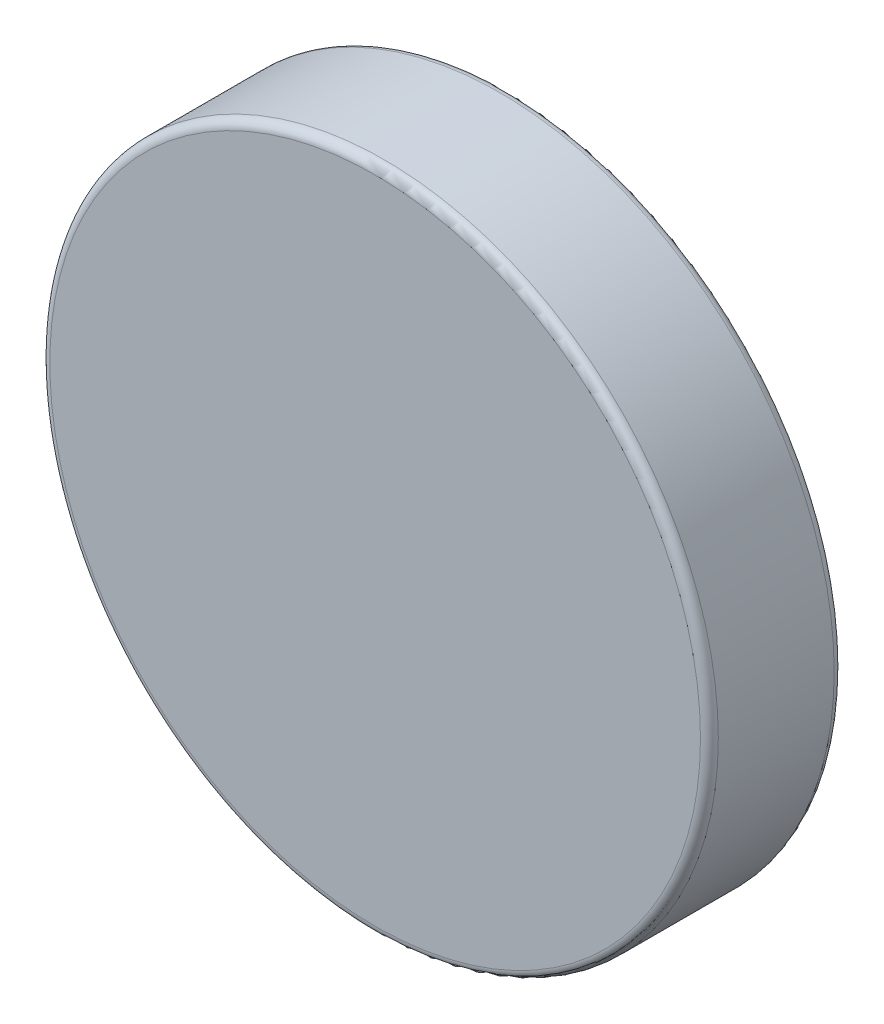
ISO-10303-21;
HEADER;
FILE_DESCRIPTION(('STEP AP214'),'2;1');
FILE_NAME('part.step','',(''),(''),'','','');
FILE_SCHEMA(('AUTOMOTIVE_DESIGN { 1 0 10303 214 1 1 1 1 }'));
ENDSEC;
DATA;
#1=APPLICATION_CONTEXT('core data for automotive mechanical design processes');
#2=APPLICATION_PROTOCOL_DEFINITION('international standard','automotive_design',2000,#1);
#3=PRODUCT_CONTEXT('',#1,'mechanical');
#4=PRODUCT('Part','Part','',(#3));
#5=PRODUCT_RELATED_PRODUCT_CATEGORY('part','',(#4));
#6=PRODUCT_DEFINITION_FORMATION('','',#4);
#7=PRODUCT_DEFINITION_CONTEXT('part definition',#1,'design');
#8=PRODUCT_DEFINITION('design','',#6,#7);
#9=PRODUCT_DEFINITION_SHAPE('','',#8);
#10=(LENGTH_UNIT() NAMED_UNIT(*) SI_UNIT(.MILLI.,.METRE.));
#11=(NAMED_UNIT(*) PLANE_ANGLE_UNIT() SI_UNIT($,.RADIAN.));
#12=(NAMED_UNIT(*) SI_UNIT($,.STERADIAN.) SOLID_ANGLE_UNIT());
#13=UNCERTAINTY_MEASURE_WITH_UNIT(LENGTH_MEASURE(1.E-05),#10,'distance_accuracy_value','');
#14=(GEOMETRIC_REPRESENTATION_CONTEXT(3) GLOBAL_UNCERTAINTY_ASSIGNED_CONTEXT((#13)) GLOBAL_UNIT_ASSIGNED_CONTEXT((#10,
#11,#12)) REPRESENTATION_CONTEXT('',''));
#15=CARTESIAN_POINT('',(0.,0.,0.));
#16=DIRECTION('',(0.,0.,1.));
#17=DIRECTION('',(1.,0.,0.));
#18=AXIS2_PLACEMENT_3D('',#15,#16,#17);
#19=CARTESIAN_POINT('',(0.,0.,3.));
#20=DIRECTION('',(0.,0.,-1.));
#21=DIRECTION('',(-1.,0.,0.));
#22=AXIS2_PLACEMENT_3D('',#19,#20,#21);
#23=CYLINDRICAL_SURFACE('',#22,7.5);
#24=CARTESIAN_POINT('',(0.,0.,0.2));
#25=DIRECTION('',(0.,0.,1.));
#26=DIRECTION('',(1.,0.,0.));
#27=AXIS2_PLACEMENT_3D('',#24,#25,#26);
#28=CIRCLE('',#27,7.5);
#29=CARTESIAN_POINT('',(7.5,0.,0.2));
#30=VERTEX_POINT('',#29);
#31=EDGE_CURVE('E44',#30,#30,#28,.T.);
#32=ORIENTED_EDGE('',*,*,#31,.T.);
#33=EDGE_LOOP('',(#32));
#34=FACE_BOUND('',#33,.T.);
#35=CARTESIAN_POINT('',(0.,0.,2.8));
#36=DIRECTION('',(0.,0.,1.));
#37=DIRECTION('',(1.,0.,0.));
#38=AXIS2_PLACEMENT_3D('',#35,#36,#37);
#39=CIRCLE('',#38,7.5);
#40=CARTESIAN_POINT('',(7.5,0.,2.8));
#41=VERTEX_POINT('',#40);
#42=EDGE_CURVE('E48',#41,#41,#39,.F.);
#43=ORIENTED_EDGE('',*,*,#42,.T.);
#44=EDGE_LOOP('',(#43));
#45=FACE_BOUND('',#44,.T.);
#46=ADVANCED_FACE('F33',(#34,#45),#23,.T.);
#47=CARTESIAN_POINT('',(0.,0.,3.));
#48=DIRECTION('',(0.,0.,1.));
#49=DIRECTION('',(1.,0.,0.));
#50=AXIS2_PLACEMENT_3D('',#47,#48,#49);
#51=PLANE('',#50);
#52=CARTESIAN_POINT('',(0.,0.,3.));
#53=DIRECTION('',(0.,0.,1.));
#54=DIRECTION('',(1.,0.,0.));
#55=AXIS2_PLACEMENT_3D('',#52,#53,#54);
#56=CIRCLE('',#55,7.3);
#57=CARTESIAN_POINT('',(7.3,0.,3.));
#58=VERTEX_POINT('',#57);
#59=EDGE_CURVE('E10',#58,#58,#56,.T.);
#60=ORIENTED_EDGE('',*,*,#59,.T.);
#61=EDGE_LOOP('',(#60));
#62=FACE_BOUND('',#61,.T.);
#63=ADVANCED_FACE('F64',(#62),#51,.T.);
#64=CARTESIAN_POINT('',(0.,0.,0.));
#65=DIRECTION('',(0.,0.,1.));
#66=DIRECTION('',(1.,0.,0.));
#67=AXIS2_PLACEMENT_3D('',#64,#65,#66);
#68=PLANE('',#67);
#69=CARTESIAN_POINT('',(0.,0.,0.));
#70=DIRECTION('',(0.,0.,1.));
#71=DIRECTION('',(1.,0.,0.));
#72=AXIS2_PLACEMENT_3D('',#69,#70,#71);
#73=CIRCLE('',#72,7.3);
#74=CARTESIAN_POINT('',(7.3,0.,0.));
#75=VERTEX_POINT('',#74);
#76=EDGE_CURVE('E40',#75,#75,#73,.F.);
#77=ORIENTED_EDGE('',*,*,#76,.T.);
#78=EDGE_LOOP('',(#77));
#79=FACE_BOUND('',#78,.T.);
#80=ADVANCED_FACE('F61',(#79),#68,.F.);
#81=CARTESIAN_POINT('',(0.,0.,0.2));
#82=DIRECTION('',(0.,0.,1.));
#83=DIRECTION('',(1.,0.,0.));
#84=AXIS2_PLACEMENT_3D('',#81,#82,#83);
#85=TOROIDAL_SURFACE('',#84,7.3,0.2);
#86=ORIENTED_EDGE('',*,*,#76,.F.);
#87=EDGE_LOOP('',(#86));
#88=FACE_BOUND('',#87,.T.);
#89=ORIENTED_EDGE('',*,*,#31,.F.);
#90=EDGE_LOOP('',(#89));
#91=FACE_BOUND('',#90,.T.);
#92=ADVANCED_FACE('F57',(#88,#91),#85,.T.);
#93=CARTESIAN_POINT('',(0.,0.,2.8));
#94=DIRECTION('',(0.,0.,1.));
#95=DIRECTION('',(1.,0.,0.));
#96=AXIS2_PLACEMENT_3D('',#93,#94,#95);
#97=TOROIDAL_SURFACE('',#96,7.3,0.2);
#98=ORIENTED_EDGE('',*,*,#42,.F.);
#99=EDGE_LOOP('',(#98));
#100=FACE_BOUND('',#99,.T.);
#101=ORIENTED_EDGE('',*,*,#59,.F.);
#102=EDGE_LOOP('',(#101));
#103=FACE_BOUND('',#102,.T.);
#104=ADVANCED_FACE('F35',(#100,#103),#97,.T.);
#105=CLOSED_SHELL('',(#46,#63,#80,#92,#104));
#106=MANIFOLD_SOLID_BREP('B2',#105);
#107=ADVANCED_BREP_SHAPE_REPRESENTATION('',(#18,#106),#14);
#108=SHAPE_DEFINITION_REPRESENTATION(#9,#107);
ENDSEC;
END-ISO-10303-21;
